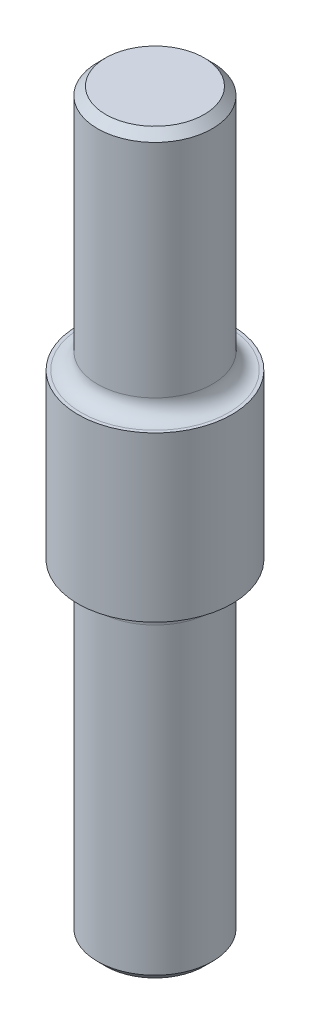
ISO-10303-21;
HEADER;
FILE_DESCRIPTION(('STEP AP214'),'2;1');
FILE_NAME('part.step','',(''),(''),'','','');
FILE_SCHEMA(('AUTOMOTIVE_DESIGN { 1 0 10303 214 1 1 1 1 }'));
ENDSEC;
DATA;
#1=APPLICATION_CONTEXT('core data for automotive mechanical design processes');
#2=APPLICATION_PROTOCOL_DEFINITION('international standard','automotive_design',2000,#1);
#3=PRODUCT_CONTEXT('',#1,'mechanical');
#4=PRODUCT('Part','Part','',(#3));
#5=PRODUCT_RELATED_PRODUCT_CATEGORY('part','',(#4));
#6=PRODUCT_DEFINITION_FORMATION('','',#4);
#7=PRODUCT_DEFINITION_CONTEXT('part definition',#1,'design');
#8=PRODUCT_DEFINITION('design','',#6,#7);
#9=PRODUCT_DEFINITION_SHAPE('','',#8);
#10=(LENGTH_UNIT() NAMED_UNIT(*) SI_UNIT(.MILLI.,.METRE.));
#11=(NAMED_UNIT(*) PLANE_ANGLE_UNIT() SI_UNIT($,.RADIAN.));
#12=(NAMED_UNIT(*) SI_UNIT($,.STERADIAN.) SOLID_ANGLE_UNIT());
#13=UNCERTAINTY_MEASURE_WITH_UNIT(LENGTH_MEASURE(1.E-05),#10,'distance_accuracy_value','');
#14=(GEOMETRIC_REPRESENTATION_CONTEXT(3) GLOBAL_UNCERTAINTY_ASSIGNED_CONTEXT((#13)) GLOBAL_UNIT_ASSIGNED_CONTEXT((#10,
#11,#12)) REPRESENTATION_CONTEXT('',''));
#15=CARTESIAN_POINT('',(0.,0.,0.));
#16=DIRECTION('',(0.,0.,1.));
#17=DIRECTION('',(1.,0.,0.));
#18=AXIS2_PLACEMENT_3D('',#15,#16,#17);
#19=CARTESIAN_POINT('',(0.,30.,0.));
#20=DIRECTION('',(0.,1.,0.));
#21=DIRECTION('',(0.,0.,1.));
#22=AXIS2_PLACEMENT_3D('',#19,#20,#21);
#23=PLANE('',#22);
#24=CARTESIAN_POINT('',(0.,30.,0.));
#25=DIRECTION('',(0.,1.,0.));
#26=DIRECTION('',(0.,0.,1.));
#27=AXIS2_PLACEMENT_3D('',#24,#25,#26);
#28=CIRCLE('',#27,4.5);
#29=CARTESIAN_POINT('',(0.,30.,4.5));
#30=VERTEX_POINT('',#29);
#31=EDGE_CURVE('E61',#30,#30,#28,.F.);
#32=ORIENTED_EDGE('',*,*,#31,.T.);
#33=EDGE_LOOP('',(#32));
#34=FACE_BOUND('',#33,.T.);
#35=CARTESIAN_POINT('',(0.,30.,0.));
#36=DIRECTION('',(0.,1.,0.));
#37=DIRECTION('',(0.,0.,1.));
#38=AXIS2_PLACEMENT_3D('',#35,#36,#37);
#39=CIRCLE('',#38,4.7);
#40=CARTESIAN_POINT('',(0.,30.,4.7));
#41=VERTEX_POINT('',#40);
#42=EDGE_CURVE('E67',#41,#41,#39,.T.);
#43=ORIENTED_EDGE('',*,*,#42,.T.);
#44=EDGE_LOOP('',(#43));
#45=FACE_BOUND('',#44,.T.);
#46=ADVANCED_FACE('F35',(#34,#45),#23,.T.);
#47=CARTESIAN_POINT('',(0.,20.,0.));
#48=DIRECTION('',(0.,-1.,0.));
#49=DIRECTION('',(0.,0.,-1.));
#50=AXIS2_PLACEMENT_3D('',#47,#48,#49);
#51=CYLINDRICAL_SURFACE('',#50,3.5);
#52=CARTESIAN_POINT('',(0.,0.499999999999997,0.));
#53=DIRECTION('',(0.,1.,0.));
#54=DIRECTION('',(0.,0.,1.));
#55=AXIS2_PLACEMENT_3D('',#52,#53,#54);
#56=CIRCLE('',#55,3.5);
#57=CARTESIAN_POINT('',(0.,0.499999999999997,3.5));
#58=VERTEX_POINT('',#57);
#59=EDGE_CURVE('E42',#58,#58,#56,.T.);
#60=ORIENTED_EDGE('',*,*,#59,.T.);
#61=EDGE_LOOP('',(#60));
#62=FACE_BOUND('',#61,.T.);
#63=CARTESIAN_POINT('',(0.,19.,0.));
#64=DIRECTION('',(0.,1.,0.));
#65=DIRECTION('',(0.,0.,1.));
#66=AXIS2_PLACEMENT_3D('',#63,#64,#65);
#67=CIRCLE('',#66,3.5);
#68=CARTESIAN_POINT('',(0.,19.,3.5));
#69=VERTEX_POINT('',#68);
#70=EDGE_CURVE('E55',#69,#69,#67,.F.);
#71=ORIENTED_EDGE('',*,*,#70,.T.);
#72=EDGE_LOOP('',(#71));
#73=FACE_BOUND('',#72,.T.);
#74=ADVANCED_FACE('F90',(#62,#73),#51,.T.);
#75=CARTESIAN_POINT('',(0.,0.,0.));
#76=DIRECTION('',(0.,1.,0.));
#77=DIRECTION('',(0.,0.,1.));
#78=AXIS2_PLACEMENT_3D('',#75,#76,#77);
#79=PLANE('',#78);
#80=CARTESIAN_POINT('',(0.,0.,0.));
#81=DIRECTION('',(0.,1.,0.));
#82=DIRECTION('',(0.,0.,1.));
#83=AXIS2_PLACEMENT_3D('',#80,#81,#82);
#84=CIRCLE('',#83,3.);
#85=CARTESIAN_POINT('',(0.,0.,3.));
#86=VERTEX_POINT('',#85);
#87=EDGE_CURVE('E10',#86,#86,#84,.F.);
#88=ORIENTED_EDGE('',*,*,#87,.T.);
#89=EDGE_LOOP('',(#88));
#90=FACE_BOUND('',#89,.T.);
#91=ADVANCED_FACE('F84',(#90),#79,.F.);
#92=CARTESIAN_POINT('',(0.,20.,0.));
#93=DIRECTION('',(0.,1.,0.));
#94=DIRECTION('',(0.,0.,1.));
#95=AXIS2_PLACEMENT_3D('',#92,#93,#94);
#96=PLANE('',#95);
#97=CARTESIAN_POINT('',(0.,20.,0.));
#98=DIRECTION('',(0.,1.,0.));
#99=DIRECTION('',(0.,0.,1.));
#100=AXIS2_PLACEMENT_3D('',#97,#98,#99);
#101=CIRCLE('',#100,4.5);
#102=CARTESIAN_POINT('',(0.,20.,4.5));
#103=VERTEX_POINT('',#102);
#104=EDGE_CURVE('E58',#103,#103,#101,.T.);
#105=ORIENTED_EDGE('',*,*,#104,.T.);
#106=EDGE_LOOP('',(#105));
#107=FACE_BOUND('',#106,.T.);
#108=CARTESIAN_POINT('',(0.,20.,0.));
#109=DIRECTION('',(0.,1.,0.));
#110=DIRECTION('',(0.,0.,1.));
#111=AXIS2_PLACEMENT_3D('',#108,#109,#110);
#112=CIRCLE('',#111,4.7);
#113=CARTESIAN_POINT('',(0.,20.,4.7));
#114=VERTEX_POINT('',#113);
#115=EDGE_CURVE('E68',#114,#114,#112,.T.);
#116=ORIENTED_EDGE('',*,*,#115,.F.);
#117=EDGE_LOOP('',(#116));
#118=FACE_BOUND('',#117,.T.);
#119=ADVANCED_FACE('F79',(#107,#118),#96,.F.);
#120=CARTESIAN_POINT('',(0.,30.,0.));
#121=DIRECTION('',(0.,-1.,0.));
#122=DIRECTION('',(0.,0.,-1.));
#123=AXIS2_PLACEMENT_3D('',#120,#121,#122);
#124=CYLINDRICAL_SURFACE('',#123,4.7);
#125=ORIENTED_EDGE('',*,*,#42,.F.);
#126=EDGE_LOOP('',(#125));
#127=FACE_BOUND('',#126,.T.);
#128=ORIENTED_EDGE('',*,*,#115,.T.);
#129=EDGE_LOOP('',(#128));
#130=FACE_BOUND('',#129,.T.);
#131=ADVANCED_FACE('F75',(#127,#130),#124,.T.);
#132=CARTESIAN_POINT('',(0.,45.,0.));
#133=DIRECTION('',(0.,-1.,0.));
#134=DIRECTION('',(0.,0.,-1.));
#135=AXIS2_PLACEMENT_3D('',#132,#133,#134);
#136=CYLINDRICAL_SURFACE('',#135,3.5);
#137=CARTESIAN_POINT('',(0.,44.5,0.));
#138=DIRECTION('',(0.,1.,0.));
#139=DIRECTION('',(0.,0.,1.));
#140=AXIS2_PLACEMENT_3D('',#137,#138,#139);
#141=CIRCLE('',#140,3.5);
#142=CARTESIAN_POINT('',(0.,44.5,3.5));
#143=VERTEX_POINT('',#142);
#144=EDGE_CURVE('E46',#143,#143,#141,.F.);
#145=ORIENTED_EDGE('',*,*,#144,.T.);
#146=EDGE_LOOP('',(#145));
#147=FACE_BOUND('',#146,.T.);
#148=CARTESIAN_POINT('',(0.,31.,0.));
#149=DIRECTION('',(0.,1.,0.));
#150=DIRECTION('',(0.,0.,1.));
#151=AXIS2_PLACEMENT_3D('',#148,#149,#150);
#152=CIRCLE('',#151,3.5);
#153=CARTESIAN_POINT('',(0.,31.,3.5));
#154=VERTEX_POINT('',#153);
#155=EDGE_CURVE('E64',#154,#154,#152,.T.);
#156=ORIENTED_EDGE('',*,*,#155,.T.);
#157=EDGE_LOOP('',(#156));
#158=FACE_BOUND('',#157,.T.);
#159=ADVANCED_FACE('F78',(#147,#158),#136,.T.);
#160=CARTESIAN_POINT('',(0.,45.,0.));
#161=DIRECTION('',(0.,1.,0.));
#162=DIRECTION('',(0.,0.,1.));
#163=AXIS2_PLACEMENT_3D('',#160,#161,#162);
#164=PLANE('',#163);
#165=CARTESIAN_POINT('',(0.,45.,0.));
#166=DIRECTION('',(0.,1.,0.));
#167=DIRECTION('',(0.,0.,1.));
#168=AXIS2_PLACEMENT_3D('',#165,#166,#167);
#169=CIRCLE('',#168,3.);
#170=CARTESIAN_POINT('',(0.,45.,3.));
#171=VERTEX_POINT('',#170);
#172=EDGE_CURVE('E50',#171,#171,#169,.T.);
#173=ORIENTED_EDGE('',*,*,#172,.T.);
#174=EDGE_LOOP('',(#173));
#175=FACE_BOUND('',#174,.T.);
#176=ADVANCED_FACE('F102',(#175),#164,.T.);
#177=CARTESIAN_POINT('',(0.,31.,0.));
#178=DIRECTION('',(0.,1.,0.));
#179=DIRECTION('',(0.,0.,1.));
#180=AXIS2_PLACEMENT_3D('',#177,#178,#179);
#181=TOROIDAL_SURFACE('',#180,4.5,1.);
#182=ORIENTED_EDGE('',*,*,#31,.F.);
#183=EDGE_LOOP('',(#182));
#184=FACE_BOUND('',#183,.T.);
#185=ORIENTED_EDGE('',*,*,#155,.F.);
#186=EDGE_LOOP('',(#185));
#187=FACE_BOUND('',#186,.T.);
#188=ADVANCED_FACE('F105',(#184,#187),#181,.F.);
#189=CARTESIAN_POINT('',(0.,19.,0.));
#190=DIRECTION('',(0.,1.,0.));
#191=DIRECTION('',(0.,0.,1.));
#192=AXIS2_PLACEMENT_3D('',#189,#190,#191);
#193=TOROIDAL_SURFACE('',#192,4.5,1.);
#194=ORIENTED_EDGE('',*,*,#70,.F.);
#195=EDGE_LOOP('',(#194));
#196=FACE_BOUND('',#195,.T.);
#197=ORIENTED_EDGE('',*,*,#104,.F.);
#198=EDGE_LOOP('',(#197));
#199=FACE_BOUND('',#198,.T.);
#200=ADVANCED_FACE('F110',(#196,#199),#193,.F.);
#201=CARTESIAN_POINT('',(0.,45.,0.));
#202=DIRECTION('',(0.,-1.,0.));
#203=DIRECTION('',(0.,0.,-1.));
#204=AXIS2_PLACEMENT_3D('',#201,#202,#203);
#205=CONICAL_SURFACE('',#204,3.,0.785398163397445);
#206=ORIENTED_EDGE('',*,*,#144,.F.);
#207=EDGE_LOOP('',(#206));
#208=FACE_BOUND('',#207,.T.);
#209=ORIENTED_EDGE('',*,*,#172,.F.);
#210=EDGE_LOOP('',(#209));
#211=FACE_BOUND('',#210,.T.);
#212=ADVANCED_FACE('F115',(#208,#211),#205,.T.);
#213=CARTESIAN_POINT('',(0.,0.499999999999997,0.));
#214=DIRECTION('',(0.,1.,0.));
#215=DIRECTION('',(0.,0.,1.));
#216=AXIS2_PLACEMENT_3D('',#213,#214,#215);
#217=CONICAL_SURFACE('',#216,3.5,0.785398163397452);
#218=ORIENTED_EDGE('',*,*,#87,.F.);
#219=EDGE_LOOP('',(#218));
#220=FACE_BOUND('',#219,.T.);
#221=ORIENTED_EDGE('',*,*,#59,.F.);
#222=EDGE_LOOP('',(#221));
#223=FACE_BOUND('',#222,.T.);
#224=ADVANCED_FACE('F37',(#220,#223),#217,.T.);
#225=CLOSED_SHELL('',(#46,#74,#91,#119,#131,#159,#176,#188,#200,#212,#224));
#226=MANIFOLD_SOLID_BREP('B2',#225);
#227=ADVANCED_BREP_SHAPE_REPRESENTATION('',(#18,#226),#14);
#228=SHAPE_DEFINITION_REPRESENTATION(#9,#227);
ENDSEC;
END-ISO-10303-21;
